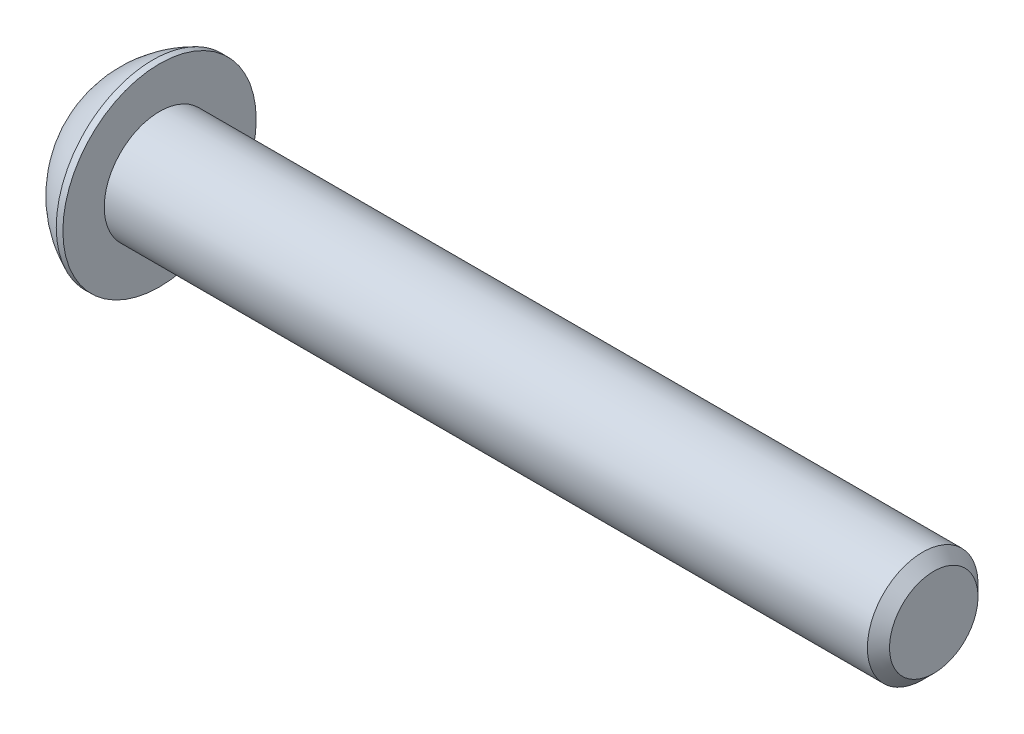
ISO-10303-21;
HEADER;
FILE_DESCRIPTION(('STEP AP214'),'2;1');
FILE_NAME('part.step','',(''),(''),'','','');
FILE_SCHEMA(('AUTOMOTIVE_DESIGN { 1 0 10303 214 1 1 1 1 }'));
ENDSEC;
DATA;
#1=APPLICATION_CONTEXT('core data for automotive mechanical design processes');
#2=APPLICATION_PROTOCOL_DEFINITION('international standard','automotive_design',2000,#1);
#3=PRODUCT_CONTEXT('',#1,'mechanical');
#4=PRODUCT('Part','Part','',(#3));
#5=PRODUCT_RELATED_PRODUCT_CATEGORY('part','',(#4));
#6=PRODUCT_DEFINITION_FORMATION('','',#4);
#7=PRODUCT_DEFINITION_CONTEXT('part definition',#1,'design');
#8=PRODUCT_DEFINITION('design','',#6,#7);
#9=PRODUCT_DEFINITION_SHAPE('','',#8);
#10=(LENGTH_UNIT() NAMED_UNIT(*) SI_UNIT(.MILLI.,.METRE.));
#11=(NAMED_UNIT(*) PLANE_ANGLE_UNIT() SI_UNIT($,.RADIAN.));
#12=(NAMED_UNIT(*) SI_UNIT($,.STERADIAN.) SOLID_ANGLE_UNIT());
#13=UNCERTAINTY_MEASURE_WITH_UNIT(LENGTH_MEASURE(1.E-05),#10,'distance_accuracy_value','');
#14=(GEOMETRIC_REPRESENTATION_CONTEXT(3) GLOBAL_UNCERTAINTY_ASSIGNED_CONTEXT((#13)) GLOBAL_UNIT_ASSIGNED_CONTEXT((#10,
#11,#12)) REPRESENTATION_CONTEXT('',''));
#15=CARTESIAN_POINT('',(0.,0.,0.));
#16=DIRECTION('',(0.,0.,1.));
#17=DIRECTION('',(1.,0.,0.));
#18=AXIS2_PLACEMENT_3D('',#15,#16,#17);
#19=CARTESIAN_POINT('',(1.32080000000045,0.,0.));
#20=DIRECTION('',(-1.,0.,0.));
#21=DIRECTION('',(0.,0.,1.));
#22=AXIS2_PLACEMENT_3D('',#19,#20,#21);
#23=CONICAL_SURFACE('',#22,1.1937999999998,1.04719755119615);
#24=CARTESIAN_POINT('',(2.01004075135902,0.,-4.44089209850063E-13));
#25=VERTEX_POINT('',#24);
#26=VERTEX_LOOP('',#25);
#27=FACE_BOUND('',#26,.T.);
#28=CARTESIAN_POINT('',(1.32080000000033,0.,0.));
#29=DIRECTION('',(-1.,0.,0.));
#30=DIRECTION('',(0.,0.,1.));
#31=AXIS2_PLACEMENT_3D('',#28,#29,#30);
#32=CIRCLE('',#31,1.19380000000002);
#33=CARTESIAN_POINT('',(1.32080000000033,0.,1.19380000000002));
#34=VERTEX_POINT('',#33);
#35=EDGE_CURVE('E19',#34,#34,#32,.T.);
#36=ORIENTED_EDGE('',*,*,#35,.T.);
#37=EDGE_LOOP('',(#36));
#38=FACE_BOUND('',#37,.T.);
#39=ADVANCED_FACE('F16',(#27,#38),#23,.F.);
#40=CARTESIAN_POINT('',(1.32080000000001,-2.29135888084632,0.));
#41=DIRECTION('',(1.,0.,0.));
#42=DIRECTION('',(0.,1.,0.));
#43=AXIS2_PLACEMENT_3D('',#40,#41,#42);
#44=PLANE('',#43);
#45=DIRECTION('',(0.,1.,0.));
#46=VECTOR('',#45,1.);
#47=CARTESIAN_POINT('',(1.32080000000001,-1.14567944042309,1.98437500000009));
#48=LINE('',#47,#46);
#49=CARTESIAN_POINT('',(1.32080000000001,1.14567944042324,1.98437500000009));
#50=VERTEX_POINT('',#49);
#51=CARTESIAN_POINT('',(1.32080000000001,-1.14567944042309,1.98437500000009));
#52=VERTEX_POINT('',#51);
#53=EDGE_CURVE('E68',#50,#52,#48,.F.);
#54=ORIENTED_EDGE('',*,*,#53,.F.);
#55=DIRECTION('',(0.,0.5,-0.866025403784439));
#56=VECTOR('',#55,1.);
#57=CARTESIAN_POINT('',(1.32080000000001,1.14567944042324,1.98437500000009));
#58=LINE('',#57,#56);
#59=CARTESIAN_POINT('',(1.32080000000001,2.29135888084636,0.));
#60=VERTEX_POINT('',#59);
#61=EDGE_CURVE('E189',#60,#50,#58,.F.);
#62=ORIENTED_EDGE('',*,*,#61,.F.);
#63=DIRECTION('',(0.,-0.500000000000003,-0.866025403784437));
#64=VECTOR('',#63,1.);
#65=CARTESIAN_POINT('',(1.32080000000001,2.29135888084635,0.));
#66=LINE('',#65,#64);
#67=CARTESIAN_POINT('',(1.32080000000001,1.14567944042318,-1.98437499999994));
#68=VERTEX_POINT('',#67);
#69=EDGE_CURVE('E193',#68,#60,#66,.F.);
#70=ORIENTED_EDGE('',*,*,#69,.F.);
#71=DIRECTION('',(0.,-1.,0.));
#72=VECTOR('',#71,1.);
#73=CARTESIAN_POINT('',(1.32080000000001,1.14567944042318,-1.98437499999994));
#74=LINE('',#73,#72);
#75=CARTESIAN_POINT('',(1.32080000000001,-1.14567944042316,-1.98437499999991));
#76=VERTEX_POINT('',#75);
#77=EDGE_CURVE('E198',#76,#68,#74,.F.);
#78=ORIENTED_EDGE('',*,*,#77,.F.);
#79=DIRECTION('',(0.,-0.500000000000001,0.866025403784438));
#80=VECTOR('',#79,1.);
#81=CARTESIAN_POINT('',(1.32080000000001,-1.14567944042317,-1.9843749999999));
#82=LINE('',#81,#80);
#83=CARTESIAN_POINT('',(1.32080000000001,-2.29135888084632,0.));
#84=VERTEX_POINT('',#83);
#85=EDGE_CURVE('E203',#84,#76,#82,.F.);
#86=ORIENTED_EDGE('',*,*,#85,.F.);
#87=DIRECTION('',(0.,0.500000000000003,0.866025403784437));
#88=VECTOR('',#87,1.);
#89=CARTESIAN_POINT('',(1.32080000000001,-2.29135888084632,0.));
#90=LINE('',#89,#88);
#91=EDGE_CURVE('E81',#52,#84,#90,.F.);
#92=ORIENTED_EDGE('',*,*,#91,.F.);
#93=EDGE_LOOP('',(#54,#62,#70,#78,#86,#92));
#94=FACE_BOUND('',#93,.T.);
#95=ORIENTED_EDGE('',*,*,#35,.F.);
#96=EDGE_LOOP('',(#95));
#97=FACE_BOUND('',#96,.T.);
#98=ADVANCED_FACE('F74',(#94,#97),#44,.F.);
#99=CARTESIAN_POINT('',(1.32080000000001,-1.14567944042309,1.98437500000009));
#100=DIRECTION('',(0.,0.,-1.));
#101=DIRECTION('',(0.,1.,0.));
#102=AXIS2_PLACEMENT_3D('',#99,#100,#101);
#103=PLANE('',#102);
#104=ORIENTED_EDGE('',*,*,#53,.T.);
#105=DIRECTION('',(1.,0.,0.));
#106=VECTOR('',#105,1.);
#107=CARTESIAN_POINT('',(1.32080000000001,-1.14567944042311,1.98437500000011));
#108=LINE('',#107,#106);
#109=CARTESIAN_POINT('',(0.,-1.14567944042309,1.98437500000009));
#110=VERTEX_POINT('',#109);
#111=EDGE_CURVE('E78',#110,#52,#108,.T.);
#112=ORIENTED_EDGE('',*,*,#111,.F.);
#113=DIRECTION('',(0.,-1.,0.));
#114=VECTOR('',#113,1.);
#115=CARTESIAN_POINT('',(0.,0.,1.98437500000009));
#116=LINE('',#115,#114);
#117=CARTESIAN_POINT('',(0.,1.14567944042324,1.98437500000009));
#118=VERTEX_POINT('',#117);
#119=EDGE_CURVE('E183',#118,#110,#116,.T.);
#120=ORIENTED_EDGE('',*,*,#119,.F.);
#121=DIRECTION('',(1.,0.,0.));
#122=VECTOR('',#121,1.);
#123=CARTESIAN_POINT('',(1.32080000000001,1.14567944042324,1.98437500000009));
#124=LINE('',#123,#122);
#125=EDGE_CURVE('E186',#50,#118,#124,.F.);
#126=ORIENTED_EDGE('',*,*,#125,.F.);
#127=EDGE_LOOP('',(#104,#112,#120,#126));
#128=FACE_BOUND('',#127,.T.);
#129=ADVANCED_FACE('F127',(#128),#103,.T.);
#130=CARTESIAN_POINT('',(1.32080000000001,-2.29135888084632,0.));
#131=DIRECTION('',(0.,0.866025403784437,-0.500000000000003));
#132=DIRECTION('',(0.,0.500000000000003,0.866025403784437));
#133=AXIS2_PLACEMENT_3D('',#130,#131,#132);
#134=PLANE('',#133);
#135=ORIENTED_EDGE('',*,*,#91,.T.);
#136=DIRECTION('',(1.,0.,0.));
#137=VECTOR('',#136,1.);
#138=CARTESIAN_POINT('',(1.32080000000001,-2.29135888084631,0.));
#139=LINE('',#138,#137);
#140=CARTESIAN_POINT('',(0.,-2.29135888084632,0.));
#141=VERTEX_POINT('',#140);
#142=EDGE_CURVE('E205',#141,#84,#139,.T.);
#143=ORIENTED_EDGE('',*,*,#142,.F.);
#144=DIRECTION('',(0.,-0.500000000000024,-0.866025403784425));
#145=VECTOR('',#144,1.);
#146=CARTESIAN_POINT('',(0.,-1.14567944042307,1.98437500000008));
#147=LINE('',#146,#145);
#148=EDGE_CURVE('E180',#110,#141,#147,.T.);
#149=ORIENTED_EDGE('',*,*,#148,.F.);
#150=ORIENTED_EDGE('',*,*,#111,.T.);
#151=EDGE_LOOP('',(#135,#143,#149,#150));
#152=FACE_BOUND('',#151,.T.);
#153=ADVANCED_FACE('F123',(#152),#134,.T.);
#154=CARTESIAN_POINT('',(1.32080000000001,-1.14567944042317,-1.9843749999999));
#155=DIRECTION('',(0.,0.866025403784438,0.500000000000001));
#156=DIRECTION('',(0.,-0.500000000000001,0.866025403784438));
#157=AXIS2_PLACEMENT_3D('',#154,#155,#156);
#158=PLANE('',#157);
#159=ORIENTED_EDGE('',*,*,#85,.T.);
#160=DIRECTION('',(1.,0.,0.));
#161=VECTOR('',#160,1.);
#162=CARTESIAN_POINT('',(1.32080000000001,-1.14567944042315,-1.98437499999994));
#163=LINE('',#162,#161);
#164=CARTESIAN_POINT('',(0.,-1.14567944042316,-1.98437499999992));
#165=VERTEX_POINT('',#164);
#166=EDGE_CURVE('E200',#165,#76,#163,.T.);
#167=ORIENTED_EDGE('',*,*,#166,.F.);
#168=DIRECTION('',(0.,0.500000000000004,-0.866025403784436));
#169=VECTOR('',#168,1.);
#170=CARTESIAN_POINT('',(0.,-2.29135888084632,0.));
#171=LINE('',#170,#169);
#172=EDGE_CURVE('E177',#141,#165,#171,.T.);
#173=ORIENTED_EDGE('',*,*,#172,.F.);
#174=ORIENTED_EDGE('',*,*,#142,.T.);
#175=EDGE_LOOP('',(#159,#167,#173,#174));
#176=FACE_BOUND('',#175,.T.);
#177=ADVANCED_FACE('F119',(#176),#158,.T.);
#178=CARTESIAN_POINT('',(1.32080000000001,1.14567944042318,-1.98437499999994));
#179=DIRECTION('',(0.,0.,1.));
#180=DIRECTION('',(0.,-1.,0.));
#181=AXIS2_PLACEMENT_3D('',#178,#179,#180);
#182=PLANE('',#181);
#183=ORIENTED_EDGE('',*,*,#77,.T.);
#184=DIRECTION('',(1.,0.,0.));
#185=VECTOR('',#184,1.);
#186=CARTESIAN_POINT('',(1.32080000000001,1.14567944042317,-1.984375));
#187=LINE('',#186,#185);
#188=CARTESIAN_POINT('',(0.,1.14567944042318,-1.98437499999995));
#189=VERTEX_POINT('',#188);
#190=EDGE_CURVE('E195',#189,#68,#187,.T.);
#191=ORIENTED_EDGE('',*,*,#190,.F.);
#192=DIRECTION('',(0.,-1.,0.));
#193=VECTOR('',#192,1.);
#194=CARTESIAN_POINT('',(0.,0.,-1.98437499999993));
#195=LINE('',#194,#193);
#196=EDGE_CURVE('E174',#165,#189,#195,.F.);
#197=ORIENTED_EDGE('',*,*,#196,.F.);
#198=ORIENTED_EDGE('',*,*,#166,.T.);
#199=EDGE_LOOP('',(#183,#191,#197,#198));
#200=FACE_BOUND('',#199,.T.);
#201=ADVANCED_FACE('F116',(#200),#182,.T.);
#202=CARTESIAN_POINT('',(1.32080000000001,2.29135888084635,0.));
#203=DIRECTION('',(0.,-0.866025403784437,0.500000000000003));
#204=DIRECTION('',(0.,-0.500000000000003,-0.866025403784437));
#205=AXIS2_PLACEMENT_3D('',#202,#203,#204);
#206=PLANE('',#205);
#207=ORIENTED_EDGE('',*,*,#69,.T.);
#208=DIRECTION('',(1.,0.,0.));
#209=VECTOR('',#208,1.);
#210=CARTESIAN_POINT('',(1.32080000000001,2.29135888084642,0.));
#211=LINE('',#210,#209);
#212=CARTESIAN_POINT('',(0.,2.29135888084636,0.));
#213=VERTEX_POINT('',#212);
#214=EDGE_CURVE('E34',#213,#60,#211,.T.);
#215=ORIENTED_EDGE('',*,*,#214,.F.);
#216=DIRECTION('',(0.,0.500000000000003,0.866025403784437));
#217=VECTOR('',#216,1.);
#218=CARTESIAN_POINT('',(0.,1.14567944042317,-1.984375));
#219=LINE('',#218,#217);
#220=EDGE_CURVE('E171',#189,#213,#219,.T.);
#221=ORIENTED_EDGE('',*,*,#220,.F.);
#222=ORIENTED_EDGE('',*,*,#190,.T.);
#223=EDGE_LOOP('',(#207,#215,#221,#222));
#224=FACE_BOUND('',#223,.T.);
#225=ADVANCED_FACE('F112',(#224),#206,.T.);
#226=CARTESIAN_POINT('',(1.32080000000001,1.14567944042324,1.98437500000009));
#227=DIRECTION('',(0.,-0.866025403784439,-0.5));
#228=DIRECTION('',(0.,0.5,-0.866025403784439));
#229=AXIS2_PLACEMENT_3D('',#226,#227,#228);
#230=PLANE('',#229);
#231=ORIENTED_EDGE('',*,*,#61,.T.);
#232=ORIENTED_EDGE('',*,*,#125,.T.);
#233=DIRECTION('',(0.,-0.499999999999968,0.866025403784457));
#234=VECTOR('',#233,1.);
#235=CARTESIAN_POINT('',(0.,2.29135888084635,0.));
#236=LINE('',#235,#234);
#237=EDGE_CURVE('E99',#213,#118,#236,.T.);
#238=ORIENTED_EDGE('',*,*,#237,.F.);
#239=ORIENTED_EDGE('',*,*,#214,.T.);
#240=EDGE_LOOP('',(#231,#232,#238,#239));
#241=FACE_BOUND('',#240,.T.);
#242=ADVANCED_FACE('F108',(#241),#230,.T.);
#243=CARTESIAN_POINT('',(0.,0.,0.));
#244=DIRECTION('',(-1.,0.,0.));
#245=DIRECTION('',(0.,-1.,0.));
#246=AXIS2_PLACEMENT_3D('',#243,#244,#245);
#247=PLANE('',#246);
#248=ORIENTED_EDGE('',*,*,#220,.T.);
#249=ORIENTED_EDGE('',*,*,#237,.T.);
#250=ORIENTED_EDGE('',*,*,#119,.T.);
#251=ORIENTED_EDGE('',*,*,#148,.T.);
#252=ORIENTED_EDGE('',*,*,#172,.T.);
#253=ORIENTED_EDGE('',*,*,#196,.T.);
#254=EDGE_LOOP('',(#248,#249,#250,#251,#252,#253));
#255=FACE_BOUND('',#254,.T.);
#256=CARTESIAN_POINT('',(0.,2.77495000000004,0.));
#257=CARTESIAN_POINT('',(0.,2.77494953309951,0.077911893752265));
#258=CARTESIAN_POINT('',(0.,2.77166578388029,0.155838105919689));
#259=CARTESIAN_POINT('',(0.,2.75855213600209,0.311152012455823));
#260=CARTESIAN_POINT('',(0.,2.74872030471471,0.388539541019475));
#261=CARTESIAN_POINT('',(0.,2.72255472645681,0.542341518735636));
#262=CARTESIAN_POINT('',(-2.70994793820671E-13,2.70621065843667,0.618754223567496));
#263=CARTESIAN_POINT('',(2.71215166270345E-13,2.66713326915781,0.769973634285941));
#264=CARTESIAN_POINT('',(1.01269126320733E-12,2.64439476297873,0.8447789836462));
#265=CARTESIAN_POINT('',(1.81921584447808E-12,2.56690195943355,1.06566239301784));
#266=CARTESIAN_POINT('',(4.76637279005743E-13,2.50280672569933,1.20857954243979));
#267=CARTESIAN_POINT('',(-4.76655399922673E-13,2.35149826934101,1.4816087456153));
#268=CARTESIAN_POINT('',(0.,2.264284167904,1.6117203123349));
#269=CARTESIAN_POINT('',(0.,2.11810939288344,1.79445660654259));
#270=CARTESIAN_POINT('',(0.,2.0667869379163,1.85333128513988));
#271=CARTESIAN_POINT('',(0.,1.95940522984453,1.96650727912783));
#272=CARTESIAN_POINT('',(0.,1.90335059143539,2.02081294920036));
#273=CARTESIAN_POINT('',(0.,1.78683891013966,2.12453280878573));
#274=CARTESIAN_POINT('',(0.,1.72637988450325,2.17394477135531));
#275=CARTESIAN_POINT('',(0.,1.60151968865714,2.26750481692899));
#276=CARTESIAN_POINT('',(0.,1.53711760864541,2.31165167810839));
#277=CARTESIAN_POINT('',(0.,1.33869902291635,2.43567242603936));
#278=CARTESIAN_POINT('',(0.,1.19934704110699,2.50723588662792));
#279=CARTESIAN_POINT('',(0.,0.910681609121916,2.62590828672813));
#280=CARTESIAN_POINT('',(0.,0.761368265357432,2.6730174874227));
#281=CARTESIAN_POINT('',(0.,0.456932649466656,2.74151230663998));
#282=CARTESIAN_POINT('',(0.,0.301810346322617,2.76289778778712));
#283=CARTESIAN_POINT('',(0.,-0.00982263870891821,2.77931595661147));
#284=CARTESIAN_POINT('',(0.,-0.166333320596415,2.77434864428868));
#285=CARTESIAN_POINT('',(0.,-0.476280836814418,2.73822217653064));
#286=CARTESIAN_POINT('',(0.,-0.629717687555952,2.70706316096972));
#287=CARTESIAN_POINT('',(0.,-0.929254830044241,2.6193798077114));
#288=CARTESIAN_POINT('',(0.,-1.07535504341316,2.56285519909559));
#289=CARTESIAN_POINT('',(0.,-1.28570692598576,2.46037024128099));
#290=CARTESIAN_POINT('',(0.,-1.35439130022283,2.42323494812886));
#291=CARTESIAN_POINT('',(0.,-1.48839128719896,2.34331277270246));
#292=CARTESIAN_POINT('',(0.,-1.55370767631784,2.30052720108822));
#293=CARTESIAN_POINT('',(0.,-1.68047292776591,2.20962421887045));
#294=CARTESIAN_POINT('',(0.,-1.74192352786817,2.16150923122339));
#295=CARTESIAN_POINT('',(0.,-1.86060297067988,2.06024311301273));
#296=CARTESIAN_POINT('',(0.,-1.91782768181712,2.00708716697621));
#297=CARTESIAN_POINT('',(0.,-2.08239462196648,1.84072208565531));
#298=CARTESIAN_POINT('',(0.,-2.18279764272598,1.72049499758412));
#299=CARTESIAN_POINT('',(0.,-2.3619575494406,1.46487629213008));
#300=CARTESIAN_POINT('',(0.,-2.44071525816753,1.32948525142797));
#301=CARTESIAN_POINT('',(0.,-2.5409888269527,1.11796734074385));
#302=CARTESIAN_POINT('',(0.,-2.57146177392723,1.04596540008337));
#303=CARTESIAN_POINT('',(0.,-2.62621251108995,0.899689259475667));
#304=CARTESIAN_POINT('',(0.,-2.6504953149556,0.825416953360854));
#305=CARTESIAN_POINT('',(0.,-2.69267708798763,0.675215808695108));
#306=CARTESIAN_POINT('',(0.,-2.71058613777933,0.599289789312993));
#307=CARTESIAN_POINT('',(0.,-2.73994710360123,0.446213628496834));
#308=CARTESIAN_POINT('',(0.,-2.75140092413867,0.36906385502469));
#309=CARTESIAN_POINT('',(0.,-2.76470470685519,0.243162088173333));
#310=CARTESIAN_POINT('',(0.,-2.76854547596614,0.194611672428479));
#311=CARTESIAN_POINT('',(0.,-2.7736682684326,0.0973760351838824));
#312=CARTESIAN_POINT('',(0.,-2.7749502917881,0.0486908136841404));
#313=CARTESIAN_POINT('',(0.,-2.77494953309943,-0.0779118937524467));
#314=CARTESIAN_POINT('',(0.,-2.77166578388021,-0.155838105919871));
#315=CARTESIAN_POINT('',(0.,-2.758552136002,-0.311152012456005));
#316=CARTESIAN_POINT('',(0.,-2.74872030471463,-0.388539541019658));
#317=CARTESIAN_POINT('',(0.,-2.72255472645672,-0.542341518735819));
#318=CARTESIAN_POINT('',(-2.70986635185437E-13,-2.70621065843658,-0.618754223567679));
#319=CARTESIAN_POINT('',(2.71207001000523E-13,-2.66713326915773,-0.769973634286124));
#320=CARTESIAN_POINT('',(1.01268841923123E-12,-2.64439476297865,-0.844778983646384));
#321=CARTESIAN_POINT('',(1.81922151887338E-12,-2.56690195943347,-1.06566239301802));
#322=CARTESIAN_POINT('',(4.7663876570586E-13,-2.50280672569924,-1.20857954243998));
#323=CARTESIAN_POINT('',(-4.76656886679312E-13,-2.35149826934092,-1.48160874561548));
#324=CARTESIAN_POINT('',(0.,-2.26428416790392,-1.61172031233509));
#325=CARTESIAN_POINT('',(0.,-2.11810939288336,-1.79445660654278));
#326=CARTESIAN_POINT('',(0.,-2.06678693791622,-1.85333128514006));
#327=CARTESIAN_POINT('',(0.,-1.95940522984444,-1.96650727912802));
#328=CARTESIAN_POINT('',(0.,-1.9033505914353,-2.02081294920054));
#329=CARTESIAN_POINT('',(0.,-1.78683891013958,-2.12453280878591));
#330=CARTESIAN_POINT('',(0.,-1.72637988450317,-2.1739447713555));
#331=CARTESIAN_POINT('',(0.,-1.60151968865706,-2.26750481692918));
#332=CARTESIAN_POINT('',(0.,-1.53711760864532,-2.31165167810857));
#333=CARTESIAN_POINT('',(0.,-1.33869902291627,-2.43567242603954));
#334=CARTESIAN_POINT('',(0.,-1.1993470411069,-2.5072358866281));
#335=CARTESIAN_POINT('',(0.,-0.910681609121828,-2.62590828672831));
#336=CARTESIAN_POINT('',(0.,-0.761368265357345,-2.67301748742288));
#337=CARTESIAN_POINT('',(0.,-0.45693264946657,-2.74151230664016));
#338=CARTESIAN_POINT('',(0.,-0.301810346322531,-2.7628977877873));
#339=CARTESIAN_POINT('',(0.,0.00982263870900505,-2.77931595661164));
#340=CARTESIAN_POINT('',(0.,0.166333320596502,-2.77434864428886));
#341=CARTESIAN_POINT('',(0.,0.476280836814504,-2.73822217653082));
#342=CARTESIAN_POINT('',(0.,0.629717687556037,-2.7070631609699));
#343=CARTESIAN_POINT('',(0.,0.929254830044326,-2.61937980771158));
#344=CARTESIAN_POINT('',(0.,1.07535504341325,-2.56285519909577));
#345=CARTESIAN_POINT('',(0.,1.28570692598584,-2.46037024128117));
#346=CARTESIAN_POINT('',(0.,1.35439130022292,-2.42323494812904));
#347=CARTESIAN_POINT('',(0.,1.48839128719905,-2.34331277270264));
#348=CARTESIAN_POINT('',(0.,1.55370767631792,-2.3005272010884));
#349=CARTESIAN_POINT('',(0.,1.680472927766,-2.20962421887063));
#350=CARTESIAN_POINT('',(0.,1.74192352786826,-2.16150923122357));
#351=CARTESIAN_POINT('',(0.,1.86060297067997,-2.06024311301291));
#352=CARTESIAN_POINT('',(0.,1.91782768181721,-2.00708716697639));
#353=CARTESIAN_POINT('',(0.,2.08239462196656,-1.84072208565548));
#354=CARTESIAN_POINT('',(0.,2.18279764272606,-1.7204949975843));
#355=CARTESIAN_POINT('',(0.,2.36195754944068,-1.46487629213026));
#356=CARTESIAN_POINT('',(0.,2.44071525816762,-1.32948525142815));
#357=CARTESIAN_POINT('',(0.,2.54098882695278,-1.11796734074403));
#358=CARTESIAN_POINT('',(0.,2.57146177392732,-1.04596540008355));
#359=CARTESIAN_POINT('',(0.,2.62621251109003,-0.899689259475846));
#360=CARTESIAN_POINT('',(0.,2.65049531495568,-0.825416953361034));
#361=CARTESIAN_POINT('',(0.,2.69267708798771,-0.675215808695288));
#362=CARTESIAN_POINT('',(0.,2.71058613777941,-0.599289789313172));
#363=CARTESIAN_POINT('',(0.,2.73994710360131,-0.446213628497012));
#364=CARTESIAN_POINT('',(0.,2.75140092413875,-0.369063855024868));
#365=CARTESIAN_POINT('',(0.,2.76470470685527,-0.243162088173511));
#366=CARTESIAN_POINT('',(0.,2.76854547596622,-0.194611672428657));
#367=CARTESIAN_POINT('',(0.,2.77366826843268,-0.0973760351840628));
#368=CARTESIAN_POINT('',(0.,2.77495029178818,-0.0486908136843215));
#369=CARTESIAN_POINT('',(0.,2.77495000000004,0.));
#370=B_SPLINE_CURVE_WITH_KNOTS('',3,(#256,#257,#258,#259,#260,#261,#262,#263,#264,#265,#266,
#267,#268,#269,#270,#271,#272,#273,#274,#275,#276,#277,#278,#279,#280,#281,#282,#283,#284,#285,
#286,#287,#288,#289,#290,#291,#292,#293,#294,#295,#296,#297,#298,#299,#300,#301,#302,#303,#304,
#305,#306,#307,#308,#309,#310,#311,#312,#313,#314,#315,#316,#317,#318,#319,#320,#321,#322,#323,
#324,#325,#326,#327,#328,#329,#330,#331,#332,#333,#334,#335,#336,#337,#338,#339,#340,#341,#342,
#343,#344,#345,#346,#347,#348,#349,#350,#351,#352,#353,#354,#355,#356,#357,#358,#359,#360,#361,
#362,#363,#364,#365,#366,#367,#368,#369),.UNSPECIFIED.,.T.,.F.,(4,2,2,2,2,2,2,2,2,2,2,2,2,2,2,2,
2,2,2,2,2,2,2,2,2,2,2,2,2,2,2,2,2,2,2,2,2,2,2,2,2,2,2,2,2,2,2,2,2,2,2,2,2,2,2,2,4),(0.,
0.233690856748163,0.467450716578751,0.701582538521471,0.935904756015414,1.40343220467667,
1.87097742791502,2.10505636898837,2.33890962270652,2.57286880998746,2.80688218486306,
3.27442101763127,3.74195485676357,4.20949119271389,4.67702752866417,5.14456136779641,
5.61210020056469,5.84611357544034,6.08007276272136,6.31392601643949,6.54800495751273,
7.01555018075072,7.48307762941212,7.71739984690652,7.95153166884955,8.18529152868023,
8.41898238542855,8.56502681353347,8.71107124163843,8.94476209838659,9.17852195821718,
9.4126537801599,9.64697599765385,10.1145034463151,10.5820486695535,10.8161276106268,
11.0499808643449,11.2839400516259,11.5179534265015,11.9854922592697,12.453026098402,
12.9205624343523,13.3880987703026,13.8556326094348,14.3231714422031,14.5571848170788,
14.7911440043598,15.0249972580779,15.2590761991512,15.7266214223891,16.1941488710506,
16.428471088545,16.662602910488,16.8963627703187,17.130053627067,17.2760980551719,
17.4221424832769),.UNSPECIFIED.);
#371=CARTESIAN_POINT('',(0.,2.77495000000004,0.));
#372=VERTEX_POINT('',#371);
#373=EDGE_CURVE('E93',#372,#372,#370,.T.);
#374=ORIENTED_EDGE('',*,*,#373,.F.);
#375=EDGE_LOOP('',(#374));
#376=FACE_BOUND('',#375,.T.);
#377=ADVANCED_FACE('F104',(#255,#376),#247,.T.);
#378=CARTESIAN_POINT('',(5.37260881410256,0.,0.));
#379=DIRECTION('',(0.,1.,0.));
#380=DIRECTION('',(1.,0.,0.));
#381=AXIS2_PLACEMENT_3D('',#378,#379,#380);
#382=SPHERICAL_SURFACE('',#381,6.04692260342999);
#383=CARTESIAN_POINT('',(2.9718,0.,0.));
#384=DIRECTION('',(-1.,0.,0.));
#385=DIRECTION('',(0.,-1.,0.));
#386=AXIS2_PLACEMENT_3D('',#383,#384,#385);
#387=CIRCLE('',#386,5.5499);
#388=CARTESIAN_POINT('',(2.9718,-5.5499,0.));
#389=VERTEX_POINT('',#388);
#390=EDGE_CURVE('E91',#389,#389,#387,.F.);
#391=ORIENTED_EDGE('',*,*,#390,.F.);
#392=EDGE_LOOP('',(#391));
#393=FACE_BOUND('',#392,.T.);
#394=ORIENTED_EDGE('',*,*,#373,.T.);
#395=EDGE_LOOP('',(#394));
#396=FACE_BOUND('',#395,.T.);
#397=ADVANCED_FACE('F100',(#393,#396),#382,.T.);
#398=CARTESIAN_POINT('',(47.8028000000002,0.,0.));
#399=DIRECTION('',(-1.,0.,0.));
#400=DIRECTION('',(0.,-1.,0.));
#401=AXIS2_PLACEMENT_3D('',#398,#399,#400);
#402=PLANE('',#401);
#403=CARTESIAN_POINT('',(47.8028000000563,0.,0.));
#404=DIRECTION('',(-1.,0.,0.));
#405=DIRECTION('',(0.,0.,1.));
#406=AXIS2_PLACEMENT_3D('',#403,#404,#405);
#407=CIRCLE('',#406,2.54000000006723);
#408=CARTESIAN_POINT('',(47.8028000000563,0.,2.54000000006727));
#409=VERTEX_POINT('',#408);
#410=EDGE_CURVE('E88',#409,#409,#407,.T.);
#411=ORIENTED_EDGE('',*,*,#410,.F.);
#412=EDGE_LOOP('',(#411));
#413=FACE_BOUND('',#412,.T.);
#414=ADVANCED_FACE('F155',(#413),#402,.F.);
#415=CARTESIAN_POINT('',(0.,0.,0.));
#416=DIRECTION('',(-1.,0.,0.));
#417=DIRECTION('',(0.,-1.,0.));
#418=AXIS2_PLACEMENT_3D('',#415,#416,#417);
#419=CYLINDRICAL_SURFACE('',#418,5.5499);
#420=ORIENTED_EDGE('',*,*,#390,.T.);
#421=EDGE_LOOP('',(#420));
#422=FACE_BOUND('',#421,.T.);
#423=CARTESIAN_POINT('',(3.35279999999999,0.,0.));
#424=DIRECTION('',(-1.,0.,0.));
#425=DIRECTION('',(0.,-1.,0.));
#426=AXIS2_PLACEMENT_3D('',#423,#424,#425);
#427=CIRCLE('',#426,5.5499);
#428=CARTESIAN_POINT('',(3.35279999999999,-5.5499,0.));
#429=VERTEX_POINT('',#428);
#430=EDGE_CURVE('E85',#429,#429,#427,.T.);
#431=ORIENTED_EDGE('',*,*,#430,.T.);
#432=EDGE_LOOP('',(#431));
#433=FACE_BOUND('',#432,.T.);
#434=ADVANCED_FACE('F152',(#422,#433),#419,.T.);
#435=CARTESIAN_POINT('',(47.1678000000679,0.,0.));
#436=DIRECTION('',(-1.,0.,0.));
#437=DIRECTION('',(0.,0.,1.));
#438=AXIS2_PLACEMENT_3D('',#435,#436,#437);
#439=CONICAL_SURFACE('',#438,3.17499999999878,0.78539816335269);
#440=ORIENTED_EDGE('',*,*,#410,.T.);
#441=EDGE_LOOP('',(#440));
#442=FACE_BOUND('',#441,.T.);
#443=CARTESIAN_POINT('',(47.1678000000002,0.,0.));
#444=DIRECTION('',(-1.,0.,0.));
#445=DIRECTION('',(0.,-1.,0.));
#446=AXIS2_PLACEMENT_3D('',#443,#444,#445);
#447=CIRCLE('',#446,3.175);
#448=CARTESIAN_POINT('',(47.1678000000002,-3.175,0.));
#449=VERTEX_POINT('',#448);
#450=EDGE_CURVE('E25',#449,#449,#447,.T.);
#451=ORIENTED_EDGE('',*,*,#450,.F.);
#452=EDGE_LOOP('',(#451));
#453=FACE_BOUND('',#452,.T.);
#454=ADVANCED_FACE('F144',(#442,#453),#439,.T.);
#455=CARTESIAN_POINT('',(3.35279999999999,3.17500000000003,-1.11022302462516E-13));
#456=DIRECTION('',(-1.,0.,0.));
#457=DIRECTION('',(0.,-1.,0.));
#458=AXIS2_PLACEMENT_3D('',#455,#456,#457);
#459=PLANE('',#458);
#460=CARTESIAN_POINT('',(3.35279999999999,0.,0.));
#461=DIRECTION('',(-1.,0.,0.));
#462=DIRECTION('',(0.,-1.,0.));
#463=AXIS2_PLACEMENT_3D('',#460,#461,#462);
#464=CIRCLE('',#463,3.175);
#465=CARTESIAN_POINT('',(3.35279999999999,-3.175,0.));
#466=VERTEX_POINT('',#465);
#467=EDGE_CURVE('E11',#466,#466,#464,.F.);
#468=ORIENTED_EDGE('',*,*,#467,.F.);
#469=EDGE_LOOP('',(#468));
#470=FACE_BOUND('',#469,.T.);
#471=ORIENTED_EDGE('',*,*,#430,.F.);
#472=EDGE_LOOP('',(#471));
#473=FACE_BOUND('',#472,.T.);
#474=ADVANCED_FACE('F138',(#470,#473),#459,.F.);
#475=CARTESIAN_POINT('',(0.,0.,0.));
#476=DIRECTION('',(-1.,0.,0.));
#477=DIRECTION('',(0.,-1.,0.));
#478=AXIS2_PLACEMENT_3D('',#475,#476,#477);
#479=CYLINDRICAL_SURFACE('',#478,3.175);
#480=ORIENTED_EDGE('',*,*,#450,.T.);
#481=EDGE_LOOP('',(#480));
#482=FACE_BOUND('',#481,.T.);
#483=ORIENTED_EDGE('',*,*,#467,.T.);
#484=EDGE_LOOP('',(#483));
#485=FACE_BOUND('',#484,.T.);
#486=ADVANCED_FACE('F136',(#482,#485),#479,.T.);
#487=CLOSED_SHELL('',(#39,#98,#129,#153,#177,#201,#225,#242,#377,#397,#414,#434,#454,#474,#486));
#488=MANIFOLD_SOLID_BREP('B1',#487);
#489=ADVANCED_BREP_SHAPE_REPRESENTATION('',(#18,#488),#14);
#490=SHAPE_DEFINITION_REPRESENTATION(#9,#489);
ENDSEC;
END-ISO-10303-21;
